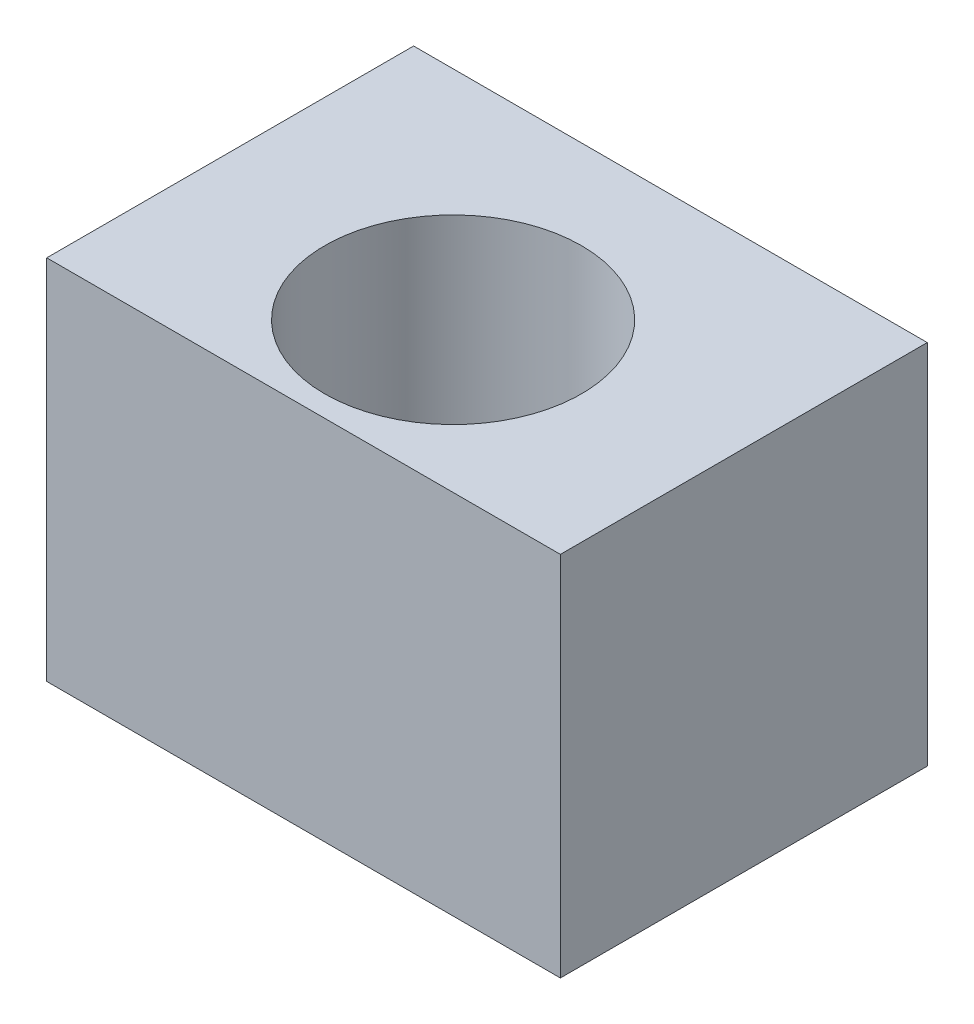
ISO-10303-21;
HEADER;
FILE_DESCRIPTION(('STEP AP214'),'2;1');
FILE_NAME('part.step','',(''),(''),'','','');
FILE_SCHEMA(('AUTOMOTIVE_DESIGN { 1 0 10303 214 1 1 1 1 }'));
ENDSEC;
DATA;
#1=APPLICATION_CONTEXT('core data for automotive mechanical design processes');
#2=APPLICATION_PROTOCOL_DEFINITION('international standard','automotive_design',2000,#1);
#3=PRODUCT_CONTEXT('',#1,'mechanical');
#4=PRODUCT('Part','Part','',(#3));
#5=PRODUCT_RELATED_PRODUCT_CATEGORY('part','',(#4));
#6=PRODUCT_DEFINITION_FORMATION('','',#4);
#7=PRODUCT_DEFINITION_CONTEXT('part definition',#1,'design');
#8=PRODUCT_DEFINITION('design','',#6,#7);
#9=PRODUCT_DEFINITION_SHAPE('','',#8);
#10=(LENGTH_UNIT() NAMED_UNIT(*) SI_UNIT(.MILLI.,.METRE.));
#11=(NAMED_UNIT(*) PLANE_ANGLE_UNIT() SI_UNIT($,.RADIAN.));
#12=(NAMED_UNIT(*) SI_UNIT($,.STERADIAN.) SOLID_ANGLE_UNIT());
#13=UNCERTAINTY_MEASURE_WITH_UNIT(LENGTH_MEASURE(1.E-05),#10,'distance_accuracy_value','');
#14=(GEOMETRIC_REPRESENTATION_CONTEXT(3) GLOBAL_UNCERTAINTY_ASSIGNED_CONTEXT((#13)) GLOBAL_UNIT_ASSIGNED_CONTEXT((#10,
#11,#12)) REPRESENTATION_CONTEXT('',''));
#15=CARTESIAN_POINT('',(0.,0.,0.));
#16=DIRECTION('',(0.,0.,1.));
#17=DIRECTION('',(1.,0.,0.));
#18=AXIS2_PLACEMENT_3D('',#15,#16,#17);
#19=CARTESIAN_POINT('',(-3.5,5.,-2.5));
#20=DIRECTION('',(0.,0.,1.));
#21=DIRECTION('',(1.,0.,0.));
#22=AXIS2_PLACEMENT_3D('',#19,#20,#21);
#23=PLANE('',#22);
#24=DIRECTION('',(-1.,0.,0.));
#25=VECTOR('',#24,1.);
#26=CARTESIAN_POINT('',(-3.5,0.,-2.5));
#27=LINE('',#26,#25);
#28=CARTESIAN_POINT('',(3.5,0.,-2.5));
#29=VERTEX_POINT('',#28);
#30=CARTESIAN_POINT('',(-3.5,0.,-2.5));
#31=VERTEX_POINT('',#30);
#32=EDGE_CURVE('E100',#29,#31,#27,.T.);
#33=ORIENTED_EDGE('',*,*,#32,.T.);
#34=DIRECTION('',(0.,-1.,0.));
#35=VECTOR('',#34,1.);
#36=CARTESIAN_POINT('',(-3.5,5.,-2.5));
#37=LINE('',#36,#35);
#38=CARTESIAN_POINT('',(-3.5,5.,-2.5));
#39=VERTEX_POINT('',#38);
#40=EDGE_CURVE('E53',#39,#31,#37,.T.);
#41=ORIENTED_EDGE('',*,*,#40,.F.);
#42=DIRECTION('',(-1.,0.,0.));
#43=VECTOR('',#42,1.);
#44=CARTESIAN_POINT('',(-3.5,5.,-2.5));
#45=LINE('',#44,#43);
#46=CARTESIAN_POINT('',(3.5,5.,-2.5));
#47=VERTEX_POINT('',#46);
#48=EDGE_CURVE('E91',#47,#39,#45,.T.);
#49=ORIENTED_EDGE('',*,*,#48,.F.);
#50=DIRECTION('',(0.,-1.,0.));
#51=VECTOR('',#50,1.);
#52=CARTESIAN_POINT('',(3.5,5.,-2.5));
#53=LINE('',#52,#51);
#54=EDGE_CURVE('E13',#47,#29,#53,.T.);
#55=ORIENTED_EDGE('',*,*,#54,.T.);
#56=EDGE_LOOP('',(#33,#41,#49,#55));
#57=FACE_BOUND('',#56,.T.);
#58=CARTESIAN_POINT('',(0.,3.2,-2.5));
#59=DIRECTION('',(0.,0.,-1.));
#60=DIRECTION('',(-1.,0.,0.));
#61=AXIS2_PLACEMENT_3D('',#58,#59,#60);
#62=CIRCLE('',#61,1.5);
#63=CARTESIAN_POINT('',(-1.5,3.2,-2.5));
#64=VERTEX_POINT('',#63);
#65=EDGE_CURVE('E124',#64,#64,#62,.T.);
#66=ORIENTED_EDGE('',*,*,#65,.F.);
#67=EDGE_LOOP('',(#66));
#68=FACE_BOUND('',#67,.T.);
#69=ADVANCED_FACE('F44',(#57,#68),#23,.F.);
#70=CARTESIAN_POINT('',(3.5,5.,2.5));
#71=DIRECTION('',(-1.,0.,0.));
#72=DIRECTION('',(0.,0.,1.));
#73=AXIS2_PLACEMENT_3D('',#70,#71,#72);
#74=PLANE('',#73);
#75=DIRECTION('',(0.,0.,-1.));
#76=VECTOR('',#75,1.);
#77=CARTESIAN_POINT('',(3.5,0.,2.5));
#78=LINE('',#77,#76);
#79=CARTESIAN_POINT('',(3.5,0.,2.5));
#80=VERTEX_POINT('',#79);
#81=EDGE_CURVE('E108',#80,#29,#78,.T.);
#82=ORIENTED_EDGE('',*,*,#81,.T.);
#83=ORIENTED_EDGE('',*,*,#54,.F.);
#84=DIRECTION('',(0.,0.,-1.));
#85=VECTOR('',#84,1.);
#86=CARTESIAN_POINT('',(3.5,5.,2.5));
#87=LINE('',#86,#85);
#88=CARTESIAN_POINT('',(3.5,5.,2.5));
#89=VERTEX_POINT('',#88);
#90=EDGE_CURVE('E96',#89,#47,#87,.T.);
#91=ORIENTED_EDGE('',*,*,#90,.F.);
#92=DIRECTION('',(0.,-1.,0.));
#93=VECTOR('',#92,1.);
#94=CARTESIAN_POINT('',(3.5,5.,2.5));
#95=LINE('',#94,#93);
#96=EDGE_CURVE('E104',#89,#80,#95,.T.);
#97=ORIENTED_EDGE('',*,*,#96,.T.);
#98=EDGE_LOOP('',(#82,#83,#91,#97));
#99=FACE_BOUND('',#98,.T.);
#100=ADVANCED_FACE('F46',(#99),#74,.F.);
#101=CARTESIAN_POINT('',(-3.5,5.,2.5));
#102=DIRECTION('',(1.,0.,0.));
#103=DIRECTION('',(0.,0.,-1.));
#104=AXIS2_PLACEMENT_3D('',#101,#102,#103);
#105=PLANE('',#104);
#106=DIRECTION('',(0.,0.,1.));
#107=VECTOR('',#106,1.);
#108=CARTESIAN_POINT('',(-3.5,0.,2.5));
#109=LINE('',#108,#107);
#110=CARTESIAN_POINT('',(-3.5,0.,2.5));
#111=VERTEX_POINT('',#110);
#112=EDGE_CURVE('E78',#31,#111,#109,.T.);
#113=ORIENTED_EDGE('',*,*,#112,.T.);
#114=DIRECTION('',(0.,-1.,0.));
#115=VECTOR('',#114,1.);
#116=CARTESIAN_POINT('',(-3.5,5.,2.5));
#117=LINE('',#116,#115);
#118=CARTESIAN_POINT('',(-3.5,5.,2.5));
#119=VERTEX_POINT('',#118);
#120=EDGE_CURVE('E101',#119,#111,#117,.T.);
#121=ORIENTED_EDGE('',*,*,#120,.F.);
#122=DIRECTION('',(0.,0.,1.));
#123=VECTOR('',#122,1.);
#124=CARTESIAN_POINT('',(-3.5,5.,2.5));
#125=LINE('',#124,#123);
#126=EDGE_CURVE('E94',#39,#119,#125,.T.);
#127=ORIENTED_EDGE('',*,*,#126,.F.);
#128=ORIENTED_EDGE('',*,*,#40,.T.);
#129=EDGE_LOOP('',(#113,#121,#127,#128));
#130=FACE_BOUND('',#129,.T.);
#131=ADVANCED_FACE('F102',(#130),#105,.F.);
#132=CARTESIAN_POINT('',(-3.5,5.,2.5));
#133=DIRECTION('',(0.,0.,-1.));
#134=DIRECTION('',(-1.,0.,0.));
#135=AXIS2_PLACEMENT_3D('',#132,#133,#134);
#136=PLANE('',#135);
#137=DIRECTION('',(1.,0.,0.));
#138=VECTOR('',#137,1.);
#139=CARTESIAN_POINT('',(-3.5,0.,2.5));
#140=LINE('',#139,#138);
#141=EDGE_CURVE('E84',#111,#80,#140,.T.);
#142=ORIENTED_EDGE('',*,*,#141,.T.);
#143=ORIENTED_EDGE('',*,*,#96,.F.);
#144=DIRECTION('',(1.,0.,0.));
#145=VECTOR('',#144,1.);
#146=CARTESIAN_POINT('',(-3.5,5.,2.5));
#147=LINE('',#146,#145);
#148=EDGE_CURVE('E61',#119,#89,#147,.T.);
#149=ORIENTED_EDGE('',*,*,#148,.F.);
#150=ORIENTED_EDGE('',*,*,#120,.T.);
#151=EDGE_LOOP('',(#142,#143,#149,#150));
#152=FACE_BOUND('',#151,.T.);
#153=ADVANCED_FACE('F116',(#152),#136,.F.);
#154=CARTESIAN_POINT('',(0.,5.,0.));
#155=DIRECTION('',(0.,-1.,0.));
#156=DIRECTION('',(0.,0.,-1.));
#157=AXIS2_PLACEMENT_3D('',#154,#155,#156);
#158=PLANE('',#157);
#159=CARTESIAN_POINT('',(0.,5.,0.461945313826801));
#160=DIRECTION('',(0.,1.,0.));
#161=DIRECTION('',(0.,0.,1.));
#162=AXIS2_PLACEMENT_3D('',#159,#160,#161);
#163=CIRCLE('',#162,1.75);
#164=CARTESIAN_POINT('',(0.,5.,2.2119453138268));
#165=VERTEX_POINT('',#164);
#166=EDGE_CURVE('E136',#165,#165,#163,.T.);
#167=ORIENTED_EDGE('',*,*,#166,.F.);
#168=EDGE_LOOP('',(#167));
#169=FACE_BOUND('',#168,.T.);
#170=ORIENTED_EDGE('',*,*,#90,.T.);
#171=ORIENTED_EDGE('',*,*,#48,.T.);
#172=ORIENTED_EDGE('',*,*,#126,.T.);
#173=ORIENTED_EDGE('',*,*,#148,.T.);
#174=EDGE_LOOP('',(#170,#171,#172,#173));
#175=FACE_BOUND('',#174,.T.);
#176=ADVANCED_FACE('F92',(#169,#175),#158,.F.);
#177=CARTESIAN_POINT('',(0.,0.,0.));
#178=DIRECTION('',(0.,-1.,0.));
#179=DIRECTION('',(0.,0.,-1.));
#180=AXIS2_PLACEMENT_3D('',#177,#178,#179);
#181=PLANE('',#180);
#182=CARTESIAN_POINT('',(0.,0.,0.461945313826801));
#183=DIRECTION('',(0.,-1.,0.));
#184=DIRECTION('',(0.,0.,-1.));
#185=AXIS2_PLACEMENT_3D('',#182,#183,#184);
#186=CIRCLE('',#185,0.849999999999999);
#187=CARTESIAN_POINT('',(0.,0.,-0.388054686173198));
#188=VERTEX_POINT('',#187);
#189=EDGE_CURVE('E127',#188,#188,#186,.T.);
#190=ORIENTED_EDGE('',*,*,#189,.F.);
#191=EDGE_LOOP('',(#190));
#192=FACE_BOUND('',#191,.T.);
#193=ORIENTED_EDGE('',*,*,#81,.F.);
#194=ORIENTED_EDGE('',*,*,#141,.F.);
#195=ORIENTED_EDGE('',*,*,#112,.F.);
#196=ORIENTED_EDGE('',*,*,#32,.F.);
#197=EDGE_LOOP('',(#193,#194,#195,#196));
#198=FACE_BOUND('',#197,.T.);
#199=ADVANCED_FACE('F119',(#192,#198),#181,.T.);
#200=CARTESIAN_POINT('',(0.,3.2,-1.5));
#201=DIRECTION('',(0.,0.,1.));
#202=DIRECTION('',(1.,0.,0.));
#203=AXIS2_PLACEMENT_3D('',#200,#201,#202);
#204=PLANE('',#203);
#205=CARTESIAN_POINT('',(0.,3.2,-1.5));
#206=DIRECTION('',(0.,0.,-1.));
#207=DIRECTION('',(-1.,0.,0.));
#208=AXIS2_PLACEMENT_3D('',#205,#206,#207);
#209=CIRCLE('',#208,1.5);
#210=CARTESIAN_POINT('',(-1.5,3.2,-1.5));
#211=VERTEX_POINT('',#210);
#212=EDGE_CURVE('E111',#211,#211,#209,.T.);
#213=ORIENTED_EDGE('',*,*,#212,.T.);
#214=EDGE_LOOP('',(#213));
#215=FACE_BOUND('',#214,.T.);
#216=ADVANCED_FACE('F148',(#215),#204,.F.);
#217=CARTESIAN_POINT('',(0.,3.2,-2.5));
#218=DIRECTION('',(0.,0.,-1.));
#219=DIRECTION('',(-1.,0.,0.));
#220=AXIS2_PLACEMENT_3D('',#217,#218,#219);
#221=CYLINDRICAL_SURFACE('',#220,1.5);
#222=ORIENTED_EDGE('',*,*,#212,.F.);
#223=EDGE_LOOP('',(#222));
#224=FACE_BOUND('',#223,.T.);
#225=ORIENTED_EDGE('',*,*,#65,.T.);
#226=EDGE_LOOP('',(#225));
#227=FACE_BOUND('',#226,.T.);
#228=ADVANCED_FACE('F182',(#224,#227),#221,.F.);
#229=CARTESIAN_POINT('',(0.,5.,0.461945313826801));
#230=DIRECTION('',(0.,1.,0.));
#231=DIRECTION('',(0.,0.,1.));
#232=AXIS2_PLACEMENT_3D('',#229,#230,#231);
#233=CYLINDRICAL_SURFACE('',#232,0.849999999999999);
#234=CARTESIAN_POINT('',(0.,2.,0.461945313826801));
#235=DIRECTION('',(0.,1.,0.));
#236=DIRECTION('',(0.,0.,1.));
#237=AXIS2_PLACEMENT_3D('',#234,#235,#236);
#238=CIRCLE('',#237,0.849999999999999);
#239=CARTESIAN_POINT('',(0.,2.,1.3119453138268));
#240=VERTEX_POINT('',#239);
#241=EDGE_CURVE('E130',#240,#240,#238,.T.);
#242=ORIENTED_EDGE('',*,*,#241,.T.);
#243=EDGE_LOOP('',(#242));
#244=FACE_BOUND('',#243,.T.);
#245=ORIENTED_EDGE('',*,*,#189,.T.);
#246=EDGE_LOOP('',(#245));
#247=FACE_BOUND('',#246,.T.);
#248=ADVANCED_FACE('F190',(#244,#247),#233,.F.);
#249=CARTESIAN_POINT('',(0.849999999999999,2.,0.461945313826801));
#250=DIRECTION('',(0.,-1.,0.));
#251=DIRECTION('',(0.,0.,-1.));
#252=AXIS2_PLACEMENT_3D('',#249,#250,#251);
#253=PLANE('',#252);
#254=ORIENTED_EDGE('',*,*,#241,.F.);
#255=EDGE_LOOP('',(#254));
#256=FACE_BOUND('',#255,.T.);
#257=CARTESIAN_POINT('',(0.,2.,0.461945313826801));
#258=DIRECTION('',(0.,1.,0.));
#259=DIRECTION('',(0.,0.,1.));
#260=AXIS2_PLACEMENT_3D('',#257,#258,#259);
#261=CIRCLE('',#260,1.75);
#262=CARTESIAN_POINT('',(0.,2.,2.2119453138268));
#263=VERTEX_POINT('',#262);
#264=EDGE_CURVE('E133',#263,#263,#261,.T.);
#265=ORIENTED_EDGE('',*,*,#264,.T.);
#266=EDGE_LOOP('',(#265));
#267=FACE_BOUND('',#266,.T.);
#268=ADVANCED_FACE('F209',(#256,#267),#253,.F.);
#269=CARTESIAN_POINT('',(0.,5.,0.461945313826801));
#270=DIRECTION('',(0.,1.,0.));
#271=DIRECTION('',(0.,0.,1.));
#272=AXIS2_PLACEMENT_3D('',#269,#270,#271);
#273=CYLINDRICAL_SURFACE('',#272,1.75);
#274=ORIENTED_EDGE('',*,*,#264,.F.);
#275=EDGE_LOOP('',(#274));
#276=FACE_BOUND('',#275,.T.);
#277=ORIENTED_EDGE('',*,*,#166,.T.);
#278=EDGE_LOOP('',(#277));
#279=FACE_BOUND('',#278,.T.);
#280=ADVANCED_FACE('F140',(#276,#279),#273,.F.);
#281=CLOSED_SHELL('',(#69,#100,#131,#153,#176,#199,#216,#228,#248,#268,#280));
#282=MANIFOLD_SOLID_BREP('B2',#281);
#283=ADVANCED_BREP_SHAPE_REPRESENTATION('',(#18,#282),#14);
#284=SHAPE_DEFINITION_REPRESENTATION(#9,#283);
ENDSEC;
END-ISO-10303-21;
